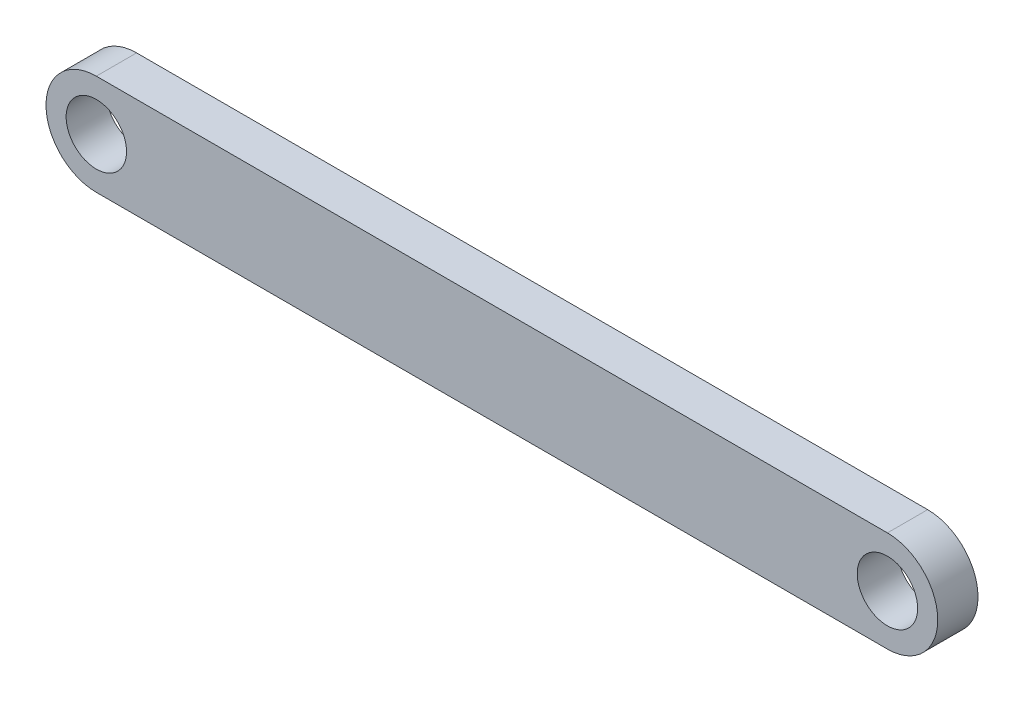
ISO-10303-21;
HEADER;
FILE_DESCRIPTION(('STEP AP214'),'2;1');
FILE_NAME('part.step','',(''),(''),'','','');
FILE_SCHEMA(('AUTOMOTIVE_DESIGN { 1 0 10303 214 1 1 1 1 }'));
ENDSEC;
DATA;
#1=APPLICATION_CONTEXT('core data for automotive mechanical design processes');
#2=APPLICATION_PROTOCOL_DEFINITION('international standard','automotive_design',2000,#1);
#3=PRODUCT_CONTEXT('',#1,'mechanical');
#4=PRODUCT('Part','Part','',(#3));
#5=PRODUCT_RELATED_PRODUCT_CATEGORY('part','',(#4));
#6=PRODUCT_DEFINITION_FORMATION('','',#4);
#7=PRODUCT_DEFINITION_CONTEXT('part definition',#1,'design');
#8=PRODUCT_DEFINITION('design','',#6,#7);
#9=PRODUCT_DEFINITION_SHAPE('','',#8);
#10=(LENGTH_UNIT() NAMED_UNIT(*) SI_UNIT(.MILLI.,.METRE.));
#11=(NAMED_UNIT(*) PLANE_ANGLE_UNIT() SI_UNIT($,.RADIAN.));
#12=(NAMED_UNIT(*) SI_UNIT($,.STERADIAN.) SOLID_ANGLE_UNIT());
#13=UNCERTAINTY_MEASURE_WITH_UNIT(LENGTH_MEASURE(1.E-05),#10,'distance_accuracy_value','');
#14=(GEOMETRIC_REPRESENTATION_CONTEXT(3) GLOBAL_UNCERTAINTY_ASSIGNED_CONTEXT((#13)) GLOBAL_UNIT_ASSIGNED_CONTEXT((#10,
#11,#12)) REPRESENTATION_CONTEXT('',''));
#15=CARTESIAN_POINT('',(0.,0.,0.));
#16=DIRECTION('',(0.,0.,1.));
#17=DIRECTION('',(1.,0.,0.));
#18=AXIS2_PLACEMENT_3D('',#15,#16,#17);
#19=CARTESIAN_POINT('',(0.0129113956876966,0.0647580552191819,2.));
#20=DIRECTION('',(0.,0.,1.));
#21=DIRECTION('',(1.,0.,0.));
#22=AXIS2_PLACEMENT_3D('',#19,#20,#21);
#23=PLANE('',#22);
#24=CARTESIAN_POINT('',(0.0129113956876966,0.0647580552191819,2.));
#25=DIRECTION('',(0.,0.,1.));
#26=DIRECTION('',(1.,0.,0.));
#27=AXIS2_PLACEMENT_3D('',#24,#25,#26);
#28=CIRCLE('',#27,1.5);
#29=CARTESIAN_POINT('',(1.5129113956877,0.0647580552191819,2.));
#30=VERTEX_POINT('',#29);
#31=EDGE_CURVE('E126',#30,#30,#28,.T.);
#32=ORIENTED_EDGE('',*,*,#31,.F.);
#33=EDGE_LOOP('',(#32));
#34=FACE_BOUND('',#33,.T.);
#35=CARTESIAN_POINT('',(0.0129113956876966,0.0647580552191819,2.));
#36=DIRECTION('',(0.,0.,1.));
#37=DIRECTION('',(1.,0.,0.));
#38=AXIS2_PLACEMENT_3D('',#35,#36,#37);
#39=CIRCLE('',#38,2.5);
#40=CARTESIAN_POINT('',(0.0129113956876966,2.56475805521918,2.));
#41=VERTEX_POINT('',#40);
#42=CARTESIAN_POINT('',(0.0129113956876966,-2.43524194478082,2.));
#43=VERTEX_POINT('',#42);
#44=EDGE_CURVE('E110',#41,#43,#39,.T.);
#45=ORIENTED_EDGE('',*,*,#44,.T.);
#46=DIRECTION('',(1.,0.,0.));
#47=VECTOR('',#46,1.);
#48=CARTESIAN_POINT('',(0.0129113956876966,-2.43524194478082,2.));
#49=LINE('',#48,#47);
#50=CARTESIAN_POINT('',(39.3129113956877,-2.43524194478082,2.));
#51=VERTEX_POINT('',#50);
#52=EDGE_CURVE('E103',#43,#51,#49,.T.);
#53=ORIENTED_EDGE('',*,*,#52,.T.);
#54=CARTESIAN_POINT('',(39.3129113956877,0.0647580552191819,2.));
#55=DIRECTION('',(0.,0.,1.));
#56=DIRECTION('',(1.,0.,0.));
#57=AXIS2_PLACEMENT_3D('',#54,#55,#56);
#58=CIRCLE('',#57,2.5);
#59=CARTESIAN_POINT('',(39.3129113956877,2.56475805521918,2.));
#60=VERTEX_POINT('',#59);
#61=EDGE_CURVE('E109',#51,#60,#58,.T.);
#62=ORIENTED_EDGE('',*,*,#61,.T.);
#63=DIRECTION('',(1.,0.,0.));
#64=VECTOR('',#63,1.);
#65=CARTESIAN_POINT('',(0.0129113956876966,2.56475805521918,2.));
#66=LINE('',#65,#64);
#67=EDGE_CURVE('E119',#41,#60,#66,.T.);
#68=ORIENTED_EDGE('',*,*,#67,.F.);
#69=EDGE_LOOP('',(#45,#53,#62,#68));
#70=FACE_BOUND('',#69,.T.);
#71=CARTESIAN_POINT('',(39.3129113956877,0.0647580552191819,2.));
#72=DIRECTION('',(0.,0.,1.));
#73=DIRECTION('',(1.,0.,0.));
#74=AXIS2_PLACEMENT_3D('',#71,#72,#73);
#75=CIRCLE('',#74,1.5);
#76=CARTESIAN_POINT('',(40.8129113956877,0.0647580552191819,2.));
#77=VERTEX_POINT('',#76);
#78=EDGE_CURVE('E139',#77,#77,#75,.T.);
#79=ORIENTED_EDGE('',*,*,#78,.F.);
#80=EDGE_LOOP('',(#79));
#81=FACE_BOUND('',#80,.T.);
#82=ADVANCED_FACE('F60',(#34,#70,#81),#23,.T.);
#83=CARTESIAN_POINT('',(0.0129113956876966,0.0647580552191819,0.));
#84=DIRECTION('',(0.,0.,1.));
#85=DIRECTION('',(1.,0.,0.));
#86=AXIS2_PLACEMENT_3D('',#83,#84,#85);
#87=PLANE('',#86);
#88=CARTESIAN_POINT('',(0.0129113956876966,0.0647580552191819,0.));
#89=DIRECTION('',(0.,0.,1.));
#90=DIRECTION('',(1.,0.,0.));
#91=AXIS2_PLACEMENT_3D('',#88,#89,#90);
#92=CIRCLE('',#91,2.5);
#93=CARTESIAN_POINT('',(0.0129113956876966,2.56475805521918,0.));
#94=VERTEX_POINT('',#93);
#95=CARTESIAN_POINT('',(0.0129113956876966,-2.43524194478082,0.));
#96=VERTEX_POINT('',#95);
#97=EDGE_CURVE('E124',#94,#96,#92,.T.);
#98=ORIENTED_EDGE('',*,*,#97,.F.);
#99=DIRECTION('',(1.,0.,0.));
#100=VECTOR('',#99,1.);
#101=CARTESIAN_POINT('',(0.0129113956876966,2.56475805521918,0.));
#102=LINE('',#101,#100);
#103=CARTESIAN_POINT('',(39.3129113956877,2.56475805521918,0.));
#104=VERTEX_POINT('',#103);
#105=EDGE_CURVE('E130',#94,#104,#102,.T.);
#106=ORIENTED_EDGE('',*,*,#105,.T.);
#107=CARTESIAN_POINT('',(39.3129113956877,0.0647580552191819,0.));
#108=DIRECTION('',(0.,0.,1.));
#109=DIRECTION('',(1.,0.,0.));
#110=AXIS2_PLACEMENT_3D('',#107,#108,#109);
#111=CIRCLE('',#110,2.5);
#112=CARTESIAN_POINT('',(39.3129113956877,-2.43524194478082,0.));
#113=VERTEX_POINT('',#112);
#114=EDGE_CURVE('E128',#113,#104,#111,.T.);
#115=ORIENTED_EDGE('',*,*,#114,.F.);
#116=DIRECTION('',(1.,0.,0.));
#117=VECTOR('',#116,1.);
#118=CARTESIAN_POINT('',(0.0129113956876966,-2.43524194478082,0.));
#119=LINE('',#118,#117);
#120=EDGE_CURVE('E115',#96,#113,#119,.T.);
#121=ORIENTED_EDGE('',*,*,#120,.F.);
#122=EDGE_LOOP('',(#98,#106,#115,#121));
#123=FACE_BOUND('',#122,.T.);
#124=CARTESIAN_POINT('',(0.0129113956876966,0.0647580552191819,0.));
#125=DIRECTION('',(0.,0.,1.));
#126=DIRECTION('',(1.,0.,0.));
#127=AXIS2_PLACEMENT_3D('',#124,#125,#126);
#128=CIRCLE('',#127,1.5);
#129=CARTESIAN_POINT('',(1.5129113956877,0.0647580552191819,0.));
#130=VERTEX_POINT('',#129);
#131=EDGE_CURVE('E136',#130,#130,#128,.T.);
#132=ORIENTED_EDGE('',*,*,#131,.T.);
#133=EDGE_LOOP('',(#132));
#134=FACE_BOUND('',#133,.T.);
#135=CARTESIAN_POINT('',(39.3129113956877,0.0647580552191819,0.));
#136=DIRECTION('',(0.,0.,1.));
#137=DIRECTION('',(1.,0.,0.));
#138=AXIS2_PLACEMENT_3D('',#135,#136,#137);
#139=CIRCLE('',#138,1.5);
#140=CARTESIAN_POINT('',(40.8129113956877,0.0647580552191819,0.));
#141=VERTEX_POINT('',#140);
#142=EDGE_CURVE('E142',#141,#141,#139,.T.);
#143=ORIENTED_EDGE('',*,*,#142,.T.);
#144=EDGE_LOOP('',(#143));
#145=FACE_BOUND('',#144,.T.);
#146=ADVANCED_FACE('F151',(#123,#134,#145),#87,.F.);
#147=CARTESIAN_POINT('',(0.0129113956876966,0.0647580552191819,2.));
#148=DIRECTION('',(0.,0.,-1.));
#149=DIRECTION('',(-1.,0.,0.));
#150=AXIS2_PLACEMENT_3D('',#147,#148,#149);
#151=CYLINDRICAL_SURFACE('',#150,2.5);
#152=ORIENTED_EDGE('',*,*,#97,.T.);
#153=DIRECTION('',(0.,0.,-1.));
#154=VECTOR('',#153,1.);
#155=CARTESIAN_POINT('',(0.0129113956876966,-2.43524194478082,2.));
#156=LINE('',#155,#154);
#157=EDGE_CURVE('E12',#43,#96,#156,.T.);
#158=ORIENTED_EDGE('',*,*,#157,.F.);
#159=ORIENTED_EDGE('',*,*,#44,.F.);
#160=DIRECTION('',(0.,0.,-1.));
#161=VECTOR('',#160,1.);
#162=CARTESIAN_POINT('',(0.0129113956876966,2.56475805521918,2.));
#163=LINE('',#162,#161);
#164=EDGE_CURVE('E77',#41,#94,#163,.T.);
#165=ORIENTED_EDGE('',*,*,#164,.T.);
#166=EDGE_LOOP('',(#152,#158,#159,#165));
#167=FACE_BOUND('',#166,.T.);
#168=ADVANCED_FACE('F62',(#167),#151,.T.);
#169=CARTESIAN_POINT('',(0.0129113956876966,-2.43524194478082,2.));
#170=DIRECTION('',(0.,1.,0.));
#171=DIRECTION('',(0.,0.,1.));
#172=AXIS2_PLACEMENT_3D('',#169,#170,#171);
#173=PLANE('',#172);
#174=ORIENTED_EDGE('',*,*,#120,.T.);
#175=DIRECTION('',(0.,0.,-1.));
#176=VECTOR('',#175,1.);
#177=CARTESIAN_POINT('',(39.3129113956877,-2.43524194478082,2.));
#178=LINE('',#177,#176);
#179=EDGE_CURVE('E69',#51,#113,#178,.T.);
#180=ORIENTED_EDGE('',*,*,#179,.F.);
#181=ORIENTED_EDGE('',*,*,#52,.F.);
#182=ORIENTED_EDGE('',*,*,#157,.T.);
#183=EDGE_LOOP('',(#174,#180,#181,#182));
#184=FACE_BOUND('',#183,.T.);
#185=ADVANCED_FACE('F114',(#184),#173,.F.);
#186=CARTESIAN_POINT('',(39.3129113956877,0.0647580552191819,2.));
#187=DIRECTION('',(0.,0.,-1.));
#188=DIRECTION('',(-1.,0.,0.));
#189=AXIS2_PLACEMENT_3D('',#186,#187,#188);
#190=CYLINDRICAL_SURFACE('',#189,2.5);
#191=ORIENTED_EDGE('',*,*,#114,.T.);
#192=DIRECTION('',(0.,0.,-1.));
#193=VECTOR('',#192,1.);
#194=CARTESIAN_POINT('',(39.3129113956877,2.56475805521918,2.));
#195=LINE('',#194,#193);
#196=EDGE_CURVE('E92',#60,#104,#195,.T.);
#197=ORIENTED_EDGE('',*,*,#196,.F.);
#198=ORIENTED_EDGE('',*,*,#61,.F.);
#199=ORIENTED_EDGE('',*,*,#179,.T.);
#200=EDGE_LOOP('',(#191,#197,#198,#199));
#201=FACE_BOUND('',#200,.T.);
#202=ADVANCED_FACE('F118',(#201),#190,.T.);
#203=CARTESIAN_POINT('',(0.0129113956876966,2.56475805521918,2.));
#204=DIRECTION('',(0.,1.,0.));
#205=DIRECTION('',(0.,0.,1.));
#206=AXIS2_PLACEMENT_3D('',#203,#204,#205);
#207=PLANE('',#206);
#208=ORIENTED_EDGE('',*,*,#105,.F.);
#209=ORIENTED_EDGE('',*,*,#164,.F.);
#210=ORIENTED_EDGE('',*,*,#67,.T.);
#211=ORIENTED_EDGE('',*,*,#196,.T.);
#212=EDGE_LOOP('',(#208,#209,#210,#211));
#213=FACE_BOUND('',#212,.T.);
#214=ADVANCED_FACE('F163',(#213),#207,.T.);
#215=CARTESIAN_POINT('',(0.0129113956876966,0.0647580552191819,2.));
#216=DIRECTION('',(0.,0.,-1.));
#217=DIRECTION('',(-1.,0.,0.));
#218=AXIS2_PLACEMENT_3D('',#215,#216,#217);
#219=CYLINDRICAL_SURFACE('',#218,1.5);
#220=ORIENTED_EDGE('',*,*,#31,.T.);
#221=EDGE_LOOP('',(#220));
#222=FACE_BOUND('',#221,.T.);
#223=ORIENTED_EDGE('',*,*,#131,.F.);
#224=EDGE_LOOP('',(#223));
#225=FACE_BOUND('',#224,.T.);
#226=ADVANCED_FACE('F160',(#222,#225),#219,.F.);
#227=CARTESIAN_POINT('',(39.3129113956877,0.0647580552191819,2.));
#228=DIRECTION('',(0.,0.,-1.));
#229=DIRECTION('',(-1.,0.,0.));
#230=AXIS2_PLACEMENT_3D('',#227,#228,#229);
#231=CYLINDRICAL_SURFACE('',#230,1.5);
#232=ORIENTED_EDGE('',*,*,#78,.T.);
#233=EDGE_LOOP('',(#232));
#234=FACE_BOUND('',#233,.T.);
#235=ORIENTED_EDGE('',*,*,#142,.F.);
#236=EDGE_LOOP('',(#235));
#237=FACE_BOUND('',#236,.T.);
#238=ADVANCED_FACE('F148',(#234,#237),#231,.F.);
#239=CLOSED_SHELL('',(#82,#146,#168,#185,#202,#214,#226,#238));
#240=MANIFOLD_SOLID_BREP('B2',#239);
#241=ADVANCED_BREP_SHAPE_REPRESENTATION('',(#18,#240),#14);
#242=SHAPE_DEFINITION_REPRESENTATION(#9,#241);
ENDSEC;
END-ISO-10303-21;
